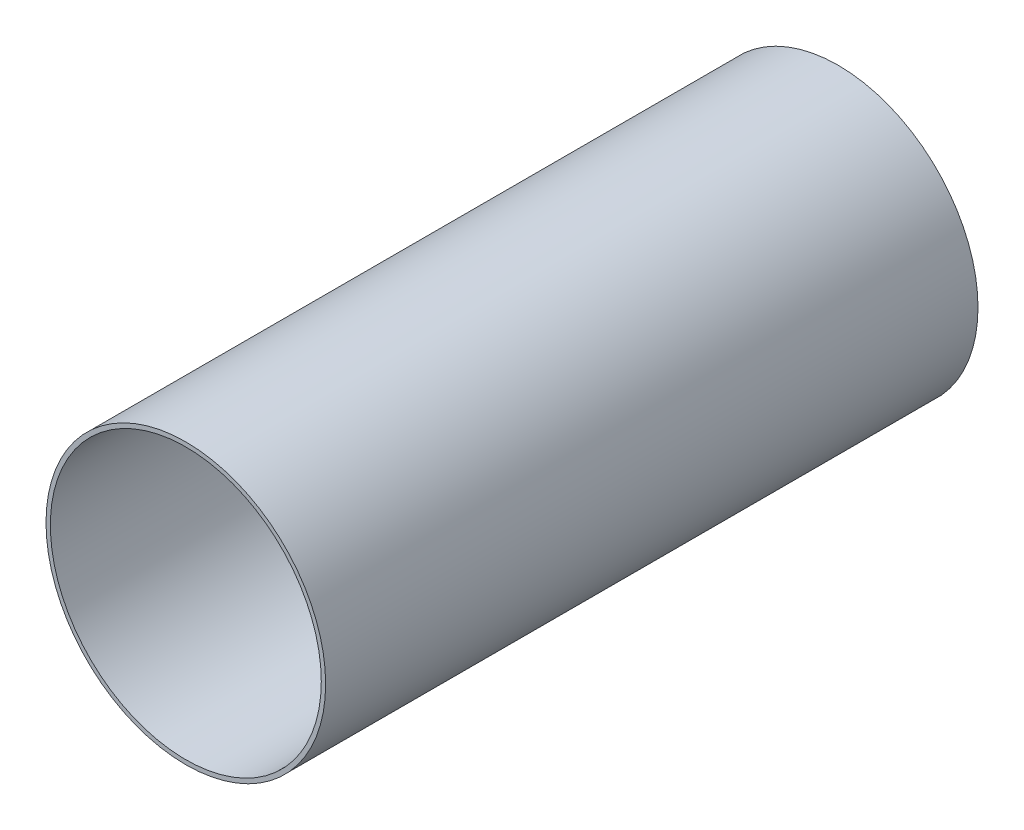
ISO-10303-21;
HEADER;
FILE_DESCRIPTION(('STEP AP214'),'2;1');
FILE_NAME('part.step','',(''),(''),'','','');
FILE_SCHEMA(('AUTOMOTIVE_DESIGN { 1 0 10303 214 1 1 1 1 }'));
ENDSEC;
DATA;
#1=APPLICATION_CONTEXT('core data for automotive mechanical design processes');
#2=APPLICATION_PROTOCOL_DEFINITION('international standard','automotive_design',2000,#1);
#3=PRODUCT_CONTEXT('',#1,'mechanical');
#4=PRODUCT('Part','Part','',(#3));
#5=PRODUCT_RELATED_PRODUCT_CATEGORY('part','',(#4));
#6=PRODUCT_DEFINITION_FORMATION('','',#4);
#7=PRODUCT_DEFINITION_CONTEXT('part definition',#1,'design');
#8=PRODUCT_DEFINITION('design','',#6,#7);
#9=PRODUCT_DEFINITION_SHAPE('','',#8);
#10=(LENGTH_UNIT() NAMED_UNIT(*) SI_UNIT(.MILLI.,.METRE.));
#11=(NAMED_UNIT(*) PLANE_ANGLE_UNIT() SI_UNIT($,.RADIAN.));
#12=(NAMED_UNIT(*) SI_UNIT($,.STERADIAN.) SOLID_ANGLE_UNIT());
#13=UNCERTAINTY_MEASURE_WITH_UNIT(LENGTH_MEASURE(1.E-05),#10,'distance_accuracy_value','');
#14=(GEOMETRIC_REPRESENTATION_CONTEXT(3) GLOBAL_UNCERTAINTY_ASSIGNED_CONTEXT((#13)) GLOBAL_UNIT_ASSIGNED_CONTEXT((#10,
#11,#12)) REPRESENTATION_CONTEXT('',''));
#15=CARTESIAN_POINT('',(0.,0.,0.));
#16=DIRECTION('',(0.,0.,1.));
#17=DIRECTION('',(1.,0.,0.));
#18=AXIS2_PLACEMENT_3D('',#15,#16,#17);
#19=CARTESIAN_POINT('',(689.,689.,-3000.));
#20=DIRECTION('',(0.,0.,1.));
#21=DIRECTION('',(1.,0.,0.));
#22=AXIS2_PLACEMENT_3D('',#19,#20,#21);
#23=CYLINDRICAL_SURFACE('',#22,643.);
#24=CARTESIAN_POINT('',(689.,689.,-3000.));
#25=DIRECTION('',(0.,0.,1.));
#26=DIRECTION('',(1.,0.,0.));
#27=AXIS2_PLACEMENT_3D('',#24,#25,#26);
#28=CIRCLE('',#27,643.);
#29=CARTESIAN_POINT('',(1332.,689.,-3000.));
#30=VERTEX_POINT('',#29);
#31=EDGE_CURVE('E10',#30,#30,#28,.T.);
#32=ORIENTED_EDGE('',*,*,#31,.T.);
#33=EDGE_LOOP('',(#32));
#34=FACE_BOUND('',#33,.T.);
#35=CARTESIAN_POINT('',(689.,689.,0.));
#36=DIRECTION('',(0.,0.,1.));
#37=DIRECTION('',(1.,0.,0.));
#38=AXIS2_PLACEMENT_3D('',#35,#36,#37);
#39=CIRCLE('',#38,643.);
#40=CARTESIAN_POINT('',(1332.,689.,0.));
#41=VERTEX_POINT('',#40);
#42=EDGE_CURVE('E30',#41,#41,#39,.T.);
#43=ORIENTED_EDGE('',*,*,#42,.F.);
#44=EDGE_LOOP('',(#43));
#45=FACE_BOUND('',#44,.T.);
#46=ADVANCED_FACE('F24',(#34,#45),#23,.T.);
#47=CARTESIAN_POINT('',(689.,689.,-3000.));
#48=DIRECTION('',(0.,0.,1.));
#49=DIRECTION('',(1.,0.,0.));
#50=AXIS2_PLACEMENT_3D('',#47,#48,#49);
#51=PLANE('',#50);
#52=CARTESIAN_POINT('',(689.,689.,-3000.));
#53=DIRECTION('',(0.,0.,1.));
#54=DIRECTION('',(1.,0.,0.));
#55=AXIS2_PLACEMENT_3D('',#52,#53,#54);
#56=CIRCLE('',#55,623.);
#57=CARTESIAN_POINT('',(1312.,689.,-3000.));
#58=VERTEX_POINT('',#57);
#59=EDGE_CURVE('E34',#58,#58,#56,.T.);
#60=ORIENTED_EDGE('',*,*,#59,.T.);
#61=EDGE_LOOP('',(#60));
#62=FACE_BOUND('',#61,.T.);
#63=ORIENTED_EDGE('',*,*,#31,.F.);
#64=EDGE_LOOP('',(#63));
#65=FACE_BOUND('',#64,.T.);
#66=ADVANCED_FACE('F48',(#62,#65),#51,.F.);
#67=CARTESIAN_POINT('',(689.,689.,0.));
#68=DIRECTION('',(0.,0.,1.));
#69=DIRECTION('',(1.,0.,0.));
#70=AXIS2_PLACEMENT_3D('',#67,#68,#69);
#71=PLANE('',#70);
#72=CARTESIAN_POINT('',(689.,689.,0.));
#73=DIRECTION('',(0.,0.,1.));
#74=DIRECTION('',(1.,0.,0.));
#75=AXIS2_PLACEMENT_3D('',#72,#73,#74);
#76=CIRCLE('',#75,623.);
#77=CARTESIAN_POINT('',(1312.,689.,0.));
#78=VERTEX_POINT('',#77);
#79=EDGE_CURVE('E38',#78,#78,#76,.T.);
#80=ORIENTED_EDGE('',*,*,#79,.F.);
#81=EDGE_LOOP('',(#80));
#82=FACE_BOUND('',#81,.T.);
#83=ORIENTED_EDGE('',*,*,#42,.T.);
#84=EDGE_LOOP('',(#83));
#85=FACE_BOUND('',#84,.T.);
#86=ADVANCED_FACE('F46',(#82,#85),#71,.T.);
#87=CARTESIAN_POINT('',(689.,689.,-3000.));
#88=DIRECTION('',(0.,0.,1.));
#89=DIRECTION('',(1.,0.,0.));
#90=AXIS2_PLACEMENT_3D('',#87,#88,#89);
#91=CYLINDRICAL_SURFACE('',#90,623.);
#92=ORIENTED_EDGE('',*,*,#59,.F.);
#93=EDGE_LOOP('',(#92));
#94=FACE_BOUND('',#93,.T.);
#95=ORIENTED_EDGE('',*,*,#79,.T.);
#96=EDGE_LOOP('',(#95));
#97=FACE_BOUND('',#96,.T.);
#98=ADVANCED_FACE('F44',(#94,#97),#91,.F.);
#99=CLOSED_SHELL('',(#46,#66,#86,#98));
#100=MANIFOLD_SOLID_BREP('B2',#99);
#101=ADVANCED_BREP_SHAPE_REPRESENTATION('',(#18,#100),#14);
#102=SHAPE_DEFINITION_REPRESENTATION(#9,#101);
ENDSEC;
END-ISO-10303-21;
